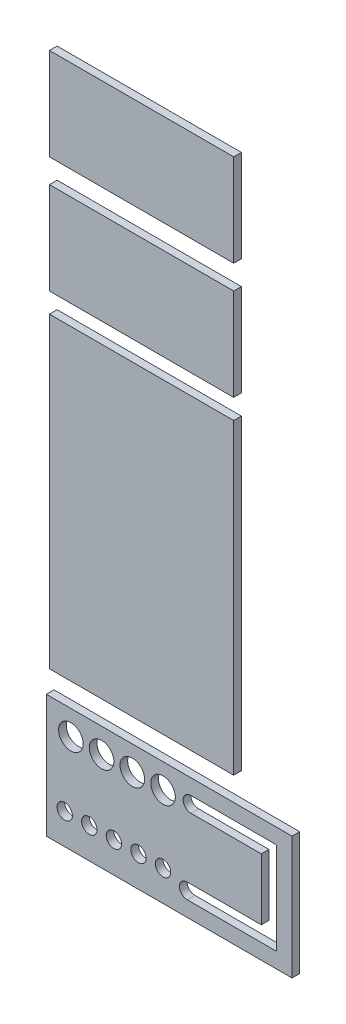
ISO-10303-21;
HEADER;
FILE_DESCRIPTION(('STEP AP214'),'2;1');
FILE_NAME('part.step','',(''),(''),'','','');
FILE_SCHEMA(('AUTOMOTIVE_DESIGN { 1 0 10303 214 1 1 1 1 }'));
ENDSEC;
DATA;
#1=APPLICATION_CONTEXT('core data for automotive mechanical design processes');
#2=APPLICATION_PROTOCOL_DEFINITION('international standard','automotive_design',2000,#1);
#3=PRODUCT_CONTEXT('',#1,'mechanical');
#4=PRODUCT('Part','Part','',(#3));
#5=PRODUCT_RELATED_PRODUCT_CATEGORY('part','',(#4));
#6=PRODUCT_DEFINITION_FORMATION('','',#4);
#7=PRODUCT_DEFINITION_CONTEXT('part definition',#1,'design');
#8=PRODUCT_DEFINITION('design','',#6,#7);
#9=PRODUCT_DEFINITION_SHAPE('','',#8);
#10=(LENGTH_UNIT() NAMED_UNIT(*) SI_UNIT(.MILLI.,.METRE.));
#11=(NAMED_UNIT(*) PLANE_ANGLE_UNIT() SI_UNIT($,.RADIAN.));
#12=(NAMED_UNIT(*) SI_UNIT($,.STERADIAN.) SOLID_ANGLE_UNIT());
#13=UNCERTAINTY_MEASURE_WITH_UNIT(LENGTH_MEASURE(1.E-05),#10,'distance_accuracy_value','');
#14=(GEOMETRIC_REPRESENTATION_CONTEXT(3) GLOBAL_UNCERTAINTY_ASSIGNED_CONTEXT((#13)) GLOBAL_UNIT_ASSIGNED_CONTEXT((#10,
#11,#12)) REPRESENTATION_CONTEXT('',''));
#15=CARTESIAN_POINT('',(0.,0.,0.));
#16=DIRECTION('',(0.,0.,1.));
#17=DIRECTION('',(1.,0.,0.));
#18=AXIS2_PLACEMENT_3D('',#15,#16,#17);
#19=CARTESIAN_POINT('',(7.52498324255558,237.752437589066,3.175));
#20=DIRECTION('',(1.,0.,0.));
#21=DIRECTION('',(0.,0.,-1.));
#22=AXIS2_PLACEMENT_3D('',#19,#20,#21);
#23=PLANE('',#22);
#24=DIRECTION('',(0.,-1.,0.));
#25=VECTOR('',#24,1.);
#26=CARTESIAN_POINT('',(7.52498324255558,237.752437589066,0.));
#27=LINE('',#26,#25);
#28=CARTESIAN_POINT('',(7.52498324255558,237.752437589066,0.));
#29=VERTEX_POINT('',#28);
#30=CARTESIAN_POINT('',(7.52498324255558,199.652437589066,0.));
#31=VERTEX_POINT('',#30);
#32=EDGE_CURVE('E107',#29,#31,#27,.T.);
#33=ORIENTED_EDGE('',*,*,#32,.T.);
#34=DIRECTION('',(0.,0.,-1.));
#35=VECTOR('',#34,1.);
#36=CARTESIAN_POINT('',(7.52498324255558,199.652437589066,3.175));
#37=LINE('',#36,#35);
#38=CARTESIAN_POINT('',(7.52498324255558,199.652437589066,3.175));
#39=VERTEX_POINT('',#38);
#40=EDGE_CURVE('E12',#39,#31,#37,.T.);
#41=ORIENTED_EDGE('',*,*,#40,.F.);
#42=DIRECTION('',(0.,-1.,0.));
#43=VECTOR('',#42,1.);
#44=CARTESIAN_POINT('',(7.52498324255558,237.752437589066,3.175));
#45=LINE('',#44,#43);
#46=CARTESIAN_POINT('',(7.52498324255558,237.752437589066,3.175));
#47=VERTEX_POINT('',#46);
#48=EDGE_CURVE('E95',#47,#39,#45,.T.);
#49=ORIENTED_EDGE('',*,*,#48,.F.);
#50=DIRECTION('',(0.,0.,-1.));
#51=VECTOR('',#50,1.);
#52=CARTESIAN_POINT('',(7.52498324255558,237.752437589066,3.175));
#53=LINE('',#52,#51);
#54=EDGE_CURVE('E103',#47,#29,#53,.T.);
#55=ORIENTED_EDGE('',*,*,#54,.T.);
#56=EDGE_LOOP('',(#33,#41,#49,#55));
#57=FACE_BOUND('',#56,.T.);
#58=ADVANCED_FACE('F44',(#57),#23,.F.);
#59=CARTESIAN_POINT('',(7.52498324255558,199.652437589066,3.175));
#60=DIRECTION('',(0.,1.,0.));
#61=DIRECTION('',(-1.,0.,0.));
#62=AXIS2_PLACEMENT_3D('',#59,#60,#61);
#63=PLANE('',#62);
#64=DIRECTION('',(1.,0.,0.));
#65=VECTOR('',#64,1.);
#66=CARTESIAN_POINT('',(7.52498324255558,199.652437589066,0.));
#67=LINE('',#66,#65);
#68=CARTESIAN_POINT('',(83.7249832425556,199.652437589066,0.));
#69=VERTEX_POINT('',#68);
#70=EDGE_CURVE('E99',#31,#69,#67,.T.);
#71=ORIENTED_EDGE('',*,*,#70,.T.);
#72=DIRECTION('',(0.,0.,-1.));
#73=VECTOR('',#72,1.);
#74=CARTESIAN_POINT('',(83.7249832425556,199.652437589066,3.175));
#75=LINE('',#74,#73);
#76=CARTESIAN_POINT('',(83.7249832425556,199.652437589066,3.175));
#77=VERTEX_POINT('',#76);
#78=EDGE_CURVE('E52',#77,#69,#75,.T.);
#79=ORIENTED_EDGE('',*,*,#78,.F.);
#80=DIRECTION('',(1.,0.,0.));
#81=VECTOR('',#80,1.);
#82=CARTESIAN_POINT('',(7.52498324255558,199.652437589066,3.175));
#83=LINE('',#82,#81);
#84=EDGE_CURVE('E90',#39,#77,#83,.T.);
#85=ORIENTED_EDGE('',*,*,#84,.F.);
#86=ORIENTED_EDGE('',*,*,#40,.T.);
#87=EDGE_LOOP('',(#71,#79,#85,#86));
#88=FACE_BOUND('',#87,.T.);
#89=ADVANCED_FACE('F98',(#88),#63,.F.);
#90=CARTESIAN_POINT('',(83.7249832425556,237.752437589066,3.175));
#91=DIRECTION('',(-1.,0.,0.));
#92=DIRECTION('',(0.,0.,1.));
#93=AXIS2_PLACEMENT_3D('',#90,#91,#92);
#94=PLANE('',#93);
#95=DIRECTION('',(0.,1.,0.));
#96=VECTOR('',#95,1.);
#97=CARTESIAN_POINT('',(83.7249832425556,237.752437589066,0.));
#98=LINE('',#97,#96);
#99=CARTESIAN_POINT('',(83.7249832425556,237.752437589066,0.));
#100=VERTEX_POINT('',#99);
#101=EDGE_CURVE('E77',#69,#100,#98,.T.);
#102=ORIENTED_EDGE('',*,*,#101,.T.);
#103=DIRECTION('',(0.,0.,-1.));
#104=VECTOR('',#103,1.);
#105=CARTESIAN_POINT('',(83.7249832425556,237.752437589066,3.175));
#106=LINE('',#105,#104);
#107=CARTESIAN_POINT('',(83.7249832425556,237.752437589066,3.175));
#108=VERTEX_POINT('',#107);
#109=EDGE_CURVE('E100',#108,#100,#106,.T.);
#110=ORIENTED_EDGE('',*,*,#109,.F.);
#111=DIRECTION('',(0.,1.,0.));
#112=VECTOR('',#111,1.);
#113=CARTESIAN_POINT('',(83.7249832425556,237.752437589066,3.175));
#114=LINE('',#113,#112);
#115=EDGE_CURVE('E93',#77,#108,#114,.T.);
#116=ORIENTED_EDGE('',*,*,#115,.F.);
#117=ORIENTED_EDGE('',*,*,#78,.T.);
#118=EDGE_LOOP('',(#102,#110,#116,#117));
#119=FACE_BOUND('',#118,.T.);
#120=ADVANCED_FACE('F101',(#119),#94,.F.);
#121=CARTESIAN_POINT('',(7.52498324255558,237.752437589066,3.175));
#122=DIRECTION('',(0.,-1.,0.));
#123=DIRECTION('',(0.,0.,-1.));
#124=AXIS2_PLACEMENT_3D('',#121,#122,#123);
#125=PLANE('',#124);
#126=DIRECTION('',(-1.,0.,0.));
#127=VECTOR('',#126,1.);
#128=CARTESIAN_POINT('',(7.52498324255558,237.752437589066,0.));
#129=LINE('',#128,#127);
#130=EDGE_CURVE('E83',#100,#29,#129,.T.);
#131=ORIENTED_EDGE('',*,*,#130,.T.);
#132=ORIENTED_EDGE('',*,*,#54,.F.);
#133=DIRECTION('',(-1.,0.,0.));
#134=VECTOR('',#133,1.);
#135=CARTESIAN_POINT('',(7.52498324255558,237.752437589066,3.175));
#136=LINE('',#135,#134);
#137=EDGE_CURVE('E60',#108,#47,#136,.T.);
#138=ORIENTED_EDGE('',*,*,#137,.F.);
#139=ORIENTED_EDGE('',*,*,#109,.T.);
#140=EDGE_LOOP('',(#131,#132,#138,#139));
#141=FACE_BOUND('',#140,.T.);
#142=ADVANCED_FACE('F114',(#141),#125,.F.);
#143=CARTESIAN_POINT('',(0.,0.,3.175));
#144=DIRECTION('',(0.,0.,1.));
#145=DIRECTION('',(1.,0.,0.));
#146=AXIS2_PLACEMENT_3D('',#143,#144,#145);
#147=PLANE('',#146);
#148=ORIENTED_EDGE('',*,*,#48,.T.);
#149=ORIENTED_EDGE('',*,*,#84,.T.);
#150=ORIENTED_EDGE('',*,*,#115,.T.);
#151=ORIENTED_EDGE('',*,*,#137,.T.);
#152=EDGE_LOOP('',(#148,#149,#150,#151));
#153=FACE_BOUND('',#152,.T.);
#154=ADVANCED_FACE('F91',(#153),#147,.T.);
#155=CARTESIAN_POINT('',(0.,0.,0.));
#156=DIRECTION('',(0.,0.,1.));
#157=DIRECTION('',(1.,0.,0.));
#158=AXIS2_PLACEMENT_3D('',#155,#156,#157);
#159=PLANE('',#158);
#160=ORIENTED_EDGE('',*,*,#32,.F.);
#161=ORIENTED_EDGE('',*,*,#130,.F.);
#162=ORIENTED_EDGE('',*,*,#101,.F.);
#163=ORIENTED_EDGE('',*,*,#70,.F.);
#164=EDGE_LOOP('',(#160,#161,#162,#163));
#165=FACE_BOUND('',#164,.T.);
#166=ADVANCED_FACE('F117',(#165),#159,.F.);
#167=CLOSED_SHELL('',(#58,#89,#120,#142,#154,#166));
#168=MANIFOLD_SOLID_BREP('B2',#167);
#169=CARTESIAN_POINT('',(7.52498324255558,285.797740762104,3.175));
#170=DIRECTION('',(1.,0.,0.));
#171=DIRECTION('',(0.,0.,-1.));
#172=AXIS2_PLACEMENT_3D('',#169,#170,#171);
#173=PLANE('',#172);
#174=DIRECTION('',(0.,-1.,0.));
#175=VECTOR('',#174,1.);
#176=CARTESIAN_POINT('',(7.52498324255558,285.797740762104,0.));
#177=LINE('',#176,#175);
#178=CARTESIAN_POINT('',(7.52498324255558,285.797740762104,0.));
#179=VERTEX_POINT('',#178);
#180=CARTESIAN_POINT('',(7.52498324255558,247.697740762104,0.));
#181=VERTEX_POINT('',#180);
#182=EDGE_CURVE('E241',#179,#181,#177,.T.);
#183=ORIENTED_EDGE('',*,*,#182,.T.);
#184=DIRECTION('',(0.,0.,-1.));
#185=VECTOR('',#184,1.);
#186=CARTESIAN_POINT('',(7.52498324255558,247.697740762104,3.175));
#187=LINE('',#186,#185);
#188=CARTESIAN_POINT('',(7.52498324255558,247.697740762104,3.175));
#189=VERTEX_POINT('',#188);
#190=EDGE_CURVE('E42',#189,#181,#187,.T.);
#191=ORIENTED_EDGE('',*,*,#190,.F.);
#192=DIRECTION('',(0.,-1.,0.));
#193=VECTOR('',#192,1.);
#194=CARTESIAN_POINT('',(7.52498324255558,285.797740762104,3.175));
#195=LINE('',#194,#193);
#196=CARTESIAN_POINT('',(7.52498324255558,285.797740762104,3.175));
#197=VERTEX_POINT('',#196);
#198=EDGE_CURVE('E229',#197,#189,#195,.T.);
#199=ORIENTED_EDGE('',*,*,#198,.F.);
#200=DIRECTION('',(0.,0.,-1.));
#201=VECTOR('',#200,1.);
#202=CARTESIAN_POINT('',(7.52498324255558,285.797740762104,3.175));
#203=LINE('',#202,#201);
#204=EDGE_CURVE('E237',#197,#179,#203,.T.);
#205=ORIENTED_EDGE('',*,*,#204,.T.);
#206=EDGE_LOOP('',(#183,#191,#199,#205));
#207=FACE_BOUND('',#206,.T.);
#208=ADVANCED_FACE('F178',(#207),#173,.F.);
#209=CARTESIAN_POINT('',(7.52498324255558,247.697740762104,3.175));
#210=DIRECTION('',(0.,1.,0.));
#211=DIRECTION('',(-1.,0.,0.));
#212=AXIS2_PLACEMENT_3D('',#209,#210,#211);
#213=PLANE('',#212);
#214=DIRECTION('',(1.,0.,0.));
#215=VECTOR('',#214,1.);
#216=CARTESIAN_POINT('',(7.52498324255558,247.697740762104,0.));
#217=LINE('',#216,#215);
#218=CARTESIAN_POINT('',(83.7249832425556,247.697740762104,0.));
#219=VERTEX_POINT('',#218);
#220=EDGE_CURVE('E233',#181,#219,#217,.T.);
#221=ORIENTED_EDGE('',*,*,#220,.T.);
#222=DIRECTION('',(0.,0.,-1.));
#223=VECTOR('',#222,1.);
#224=CARTESIAN_POINT('',(83.7249832425556,247.697740762104,3.175));
#225=LINE('',#224,#223);
#226=CARTESIAN_POINT('',(83.7249832425556,247.697740762104,3.175));
#227=VERTEX_POINT('',#226);
#228=EDGE_CURVE('E186',#227,#219,#225,.T.);
#229=ORIENTED_EDGE('',*,*,#228,.F.);
#230=DIRECTION('',(1.,0.,0.));
#231=VECTOR('',#230,1.);
#232=CARTESIAN_POINT('',(7.52498324255558,247.697740762104,3.175));
#233=LINE('',#232,#231);
#234=EDGE_CURVE('E224',#189,#227,#233,.T.);
#235=ORIENTED_EDGE('',*,*,#234,.F.);
#236=ORIENTED_EDGE('',*,*,#190,.T.);
#237=EDGE_LOOP('',(#221,#229,#235,#236));
#238=FACE_BOUND('',#237,.T.);
#239=ADVANCED_FACE('F232',(#238),#213,.F.);
#240=CARTESIAN_POINT('',(83.7249832425556,285.797740762104,3.175));
#241=DIRECTION('',(-1.,0.,0.));
#242=DIRECTION('',(0.,-1.,0.));
#243=AXIS2_PLACEMENT_3D('',#240,#241,#242);
#244=PLANE('',#243);
#245=DIRECTION('',(0.,1.,0.));
#246=VECTOR('',#245,1.);
#247=CARTESIAN_POINT('',(83.7249832425556,285.797740762104,0.));
#248=LINE('',#247,#246);
#249=CARTESIAN_POINT('',(83.7249832425556,285.797740762104,0.));
#250=VERTEX_POINT('',#249);
#251=EDGE_CURVE('E211',#219,#250,#248,.T.);
#252=ORIENTED_EDGE('',*,*,#251,.T.);
#253=DIRECTION('',(0.,0.,-1.));
#254=VECTOR('',#253,1.);
#255=CARTESIAN_POINT('',(83.7249832425556,285.797740762104,3.175));
#256=LINE('',#255,#254);
#257=CARTESIAN_POINT('',(83.7249832425556,285.797740762104,3.175));
#258=VERTEX_POINT('',#257);
#259=EDGE_CURVE('E234',#258,#250,#256,.T.);
#260=ORIENTED_EDGE('',*,*,#259,.F.);
#261=DIRECTION('',(0.,1.,0.));
#262=VECTOR('',#261,1.);
#263=CARTESIAN_POINT('',(83.7249832425556,285.797740762104,3.175));
#264=LINE('',#263,#262);
#265=EDGE_CURVE('E227',#227,#258,#264,.T.);
#266=ORIENTED_EDGE('',*,*,#265,.F.);
#267=ORIENTED_EDGE('',*,*,#228,.T.);
#268=EDGE_LOOP('',(#252,#260,#266,#267));
#269=FACE_BOUND('',#268,.T.);
#270=ADVANCED_FACE('F235',(#269),#244,.F.);
#271=CARTESIAN_POINT('',(7.52498324255558,285.797740762104,3.175));
#272=DIRECTION('',(0.,-1.,0.));
#273=DIRECTION('',(0.,0.,-1.));
#274=AXIS2_PLACEMENT_3D('',#271,#272,#273);
#275=PLANE('',#274);
#276=DIRECTION('',(-1.,0.,0.));
#277=VECTOR('',#276,1.);
#278=CARTESIAN_POINT('',(7.52498324255558,285.797740762104,0.));
#279=LINE('',#278,#277);
#280=EDGE_CURVE('E217',#250,#179,#279,.T.);
#281=ORIENTED_EDGE('',*,*,#280,.T.);
#282=ORIENTED_EDGE('',*,*,#204,.F.);
#283=DIRECTION('',(-1.,0.,0.));
#284=VECTOR('',#283,1.);
#285=CARTESIAN_POINT('',(7.52498324255558,285.797740762104,3.175));
#286=LINE('',#285,#284);
#287=EDGE_CURVE('E194',#258,#197,#286,.T.);
#288=ORIENTED_EDGE('',*,*,#287,.F.);
#289=ORIENTED_EDGE('',*,*,#259,.T.);
#290=EDGE_LOOP('',(#281,#282,#288,#289));
#291=FACE_BOUND('',#290,.T.);
#292=ADVANCED_FACE('F248',(#291),#275,.F.);
#293=CARTESIAN_POINT('',(0.,0.,3.175));
#294=DIRECTION('',(0.,0.,1.));
#295=DIRECTION('',(1.,0.,0.));
#296=AXIS2_PLACEMENT_3D('',#293,#294,#295);
#297=PLANE('',#296);
#298=ORIENTED_EDGE('',*,*,#198,.T.);
#299=ORIENTED_EDGE('',*,*,#234,.T.);
#300=ORIENTED_EDGE('',*,*,#265,.T.);
#301=ORIENTED_EDGE('',*,*,#287,.T.);
#302=EDGE_LOOP('',(#298,#299,#300,#301));
#303=FACE_BOUND('',#302,.T.);
#304=ADVANCED_FACE('F225',(#303),#297,.T.);
#305=CARTESIAN_POINT('',(0.,0.,0.));
#306=DIRECTION('',(0.,0.,1.));
#307=DIRECTION('',(1.,0.,0.));
#308=AXIS2_PLACEMENT_3D('',#305,#306,#307);
#309=PLANE('',#308);
#310=ORIENTED_EDGE('',*,*,#182,.F.);
#311=ORIENTED_EDGE('',*,*,#280,.F.);
#312=ORIENTED_EDGE('',*,*,#251,.F.);
#313=ORIENTED_EDGE('',*,*,#220,.F.);
#314=EDGE_LOOP('',(#310,#311,#312,#313));
#315=FACE_BOUND('',#314,.T.);
#316=ADVANCED_FACE('F251',(#315),#309,.F.);
#317=CLOSED_SHELL('',(#208,#239,#270,#292,#304,#316));
#318=MANIFOLD_SOLID_BREP('B6',#317);
#319=CARTESIAN_POINT('',(7.52498324255558,191.387090926258,3.175));
#320=DIRECTION('',(1.,0.,0.));
#321=DIRECTION('',(0.,0.,-1.));
#322=AXIS2_PLACEMENT_3D('',#319,#320,#321);
#323=PLANE('',#322);
#324=DIRECTION('',(0.,-1.,0.));
#325=VECTOR('',#324,1.);
#326=CARTESIAN_POINT('',(7.52498324255558,191.387090926258,0.));
#327=LINE('',#326,#325);
#328=CARTESIAN_POINT('',(7.52498324255558,191.387090926258,0.));
#329=VERTEX_POINT('',#328);
#330=CARTESIAN_POINT('',(7.52498324255558,64.3870909262584,0.));
#331=VERTEX_POINT('',#330);
#332=EDGE_CURVE('E374',#329,#331,#327,.T.);
#333=ORIENTED_EDGE('',*,*,#332,.T.);
#334=DIRECTION('',(0.,0.,-1.));
#335=VECTOR('',#334,1.);
#336=CARTESIAN_POINT('',(7.52498324255558,64.3870909262584,3.175));
#337=LINE('',#336,#335);
#338=CARTESIAN_POINT('',(7.52498324255558,64.3870909262584,3.175));
#339=VERTEX_POINT('',#338);
#340=EDGE_CURVE('E176',#339,#331,#337,.T.);
#341=ORIENTED_EDGE('',*,*,#340,.F.);
#342=DIRECTION('',(0.,-1.,0.));
#343=VECTOR('',#342,1.);
#344=CARTESIAN_POINT('',(7.52498324255558,191.387090926258,3.175));
#345=LINE('',#344,#343);
#346=CARTESIAN_POINT('',(7.52498324255558,191.387090926258,3.175));
#347=VERTEX_POINT('',#346);
#348=EDGE_CURVE('E362',#347,#339,#345,.T.);
#349=ORIENTED_EDGE('',*,*,#348,.F.);
#350=DIRECTION('',(0.,0.,-1.));
#351=VECTOR('',#350,1.);
#352=CARTESIAN_POINT('',(7.52498324255558,191.387090926258,3.175));
#353=LINE('',#352,#351);
#354=EDGE_CURVE('E370',#347,#329,#353,.T.);
#355=ORIENTED_EDGE('',*,*,#354,.T.);
#356=EDGE_LOOP('',(#333,#341,#349,#355));
#357=FACE_BOUND('',#356,.T.);
#358=ADVANCED_FACE('F311',(#357),#323,.F.);
#359=CARTESIAN_POINT('',(7.52498324255558,64.3870909262584,3.175));
#360=DIRECTION('',(0.,1.,0.));
#361=DIRECTION('',(-1.,0.,0.));
#362=AXIS2_PLACEMENT_3D('',#359,#360,#361);
#363=PLANE('',#362);
#364=DIRECTION('',(1.,0.,0.));
#365=VECTOR('',#364,1.);
#366=CARTESIAN_POINT('',(7.52498324255558,64.3870909262584,0.));
#367=LINE('',#366,#365);
#368=CARTESIAN_POINT('',(83.7249832425556,64.3870909262584,0.));
#369=VERTEX_POINT('',#368);
#370=EDGE_CURVE('E366',#331,#369,#367,.T.);
#371=ORIENTED_EDGE('',*,*,#370,.T.);
#372=DIRECTION('',(0.,0.,-1.));
#373=VECTOR('',#372,1.);
#374=CARTESIAN_POINT('',(83.7249832425556,64.3870909262584,3.175));
#375=LINE('',#374,#373);
#376=CARTESIAN_POINT('',(83.7249832425556,64.3870909262584,3.175));
#377=VERTEX_POINT('',#376);
#378=EDGE_CURVE('E319',#377,#369,#375,.T.);
#379=ORIENTED_EDGE('',*,*,#378,.F.);
#380=DIRECTION('',(1.,0.,0.));
#381=VECTOR('',#380,1.);
#382=CARTESIAN_POINT('',(7.52498324255558,64.3870909262584,3.175));
#383=LINE('',#382,#381);
#384=EDGE_CURVE('E357',#339,#377,#383,.T.);
#385=ORIENTED_EDGE('',*,*,#384,.F.);
#386=ORIENTED_EDGE('',*,*,#340,.T.);
#387=EDGE_LOOP('',(#371,#379,#385,#386));
#388=FACE_BOUND('',#387,.T.);
#389=ADVANCED_FACE('F365',(#388),#363,.F.);
#390=CARTESIAN_POINT('',(83.7249832425556,191.387090926258,3.175));
#391=DIRECTION('',(-1.,0.,0.));
#392=DIRECTION('',(0.,0.,1.));
#393=AXIS2_PLACEMENT_3D('',#390,#391,#392);
#394=PLANE('',#393);
#395=DIRECTION('',(0.,1.,0.));
#396=VECTOR('',#395,1.);
#397=CARTESIAN_POINT('',(83.7249832425556,191.387090926258,0.));
#398=LINE('',#397,#396);
#399=CARTESIAN_POINT('',(83.7249832425556,191.387090926258,0.));
#400=VERTEX_POINT('',#399);
#401=EDGE_CURVE('E344',#369,#400,#398,.T.);
#402=ORIENTED_EDGE('',*,*,#401,.T.);
#403=DIRECTION('',(0.,0.,-1.));
#404=VECTOR('',#403,1.);
#405=CARTESIAN_POINT('',(83.7249832425556,191.387090926258,3.175));
#406=LINE('',#405,#404);
#407=CARTESIAN_POINT('',(83.7249832425556,191.387090926258,3.175));
#408=VERTEX_POINT('',#407);
#409=EDGE_CURVE('E367',#408,#400,#406,.T.);
#410=ORIENTED_EDGE('',*,*,#409,.F.);
#411=DIRECTION('',(0.,1.,0.));
#412=VECTOR('',#411,1.);
#413=CARTESIAN_POINT('',(83.7249832425556,191.387090926258,3.175));
#414=LINE('',#413,#412);
#415=EDGE_CURVE('E360',#377,#408,#414,.T.);
#416=ORIENTED_EDGE('',*,*,#415,.F.);
#417=ORIENTED_EDGE('',*,*,#378,.T.);
#418=EDGE_LOOP('',(#402,#410,#416,#417));
#419=FACE_BOUND('',#418,.T.);
#420=ADVANCED_FACE('F368',(#419),#394,.F.);
#421=CARTESIAN_POINT('',(7.52498324255558,191.387090926258,3.175));
#422=DIRECTION('',(0.,-1.,0.));
#423=DIRECTION('',(0.,0.,-1.));
#424=AXIS2_PLACEMENT_3D('',#421,#422,#423);
#425=PLANE('',#424);
#426=DIRECTION('',(-1.,0.,0.));
#427=VECTOR('',#426,1.);
#428=CARTESIAN_POINT('',(7.52498324255558,191.387090926258,0.));
#429=LINE('',#428,#427);
#430=EDGE_CURVE('E350',#400,#329,#429,.T.);
#431=ORIENTED_EDGE('',*,*,#430,.T.);
#432=ORIENTED_EDGE('',*,*,#354,.F.);
#433=DIRECTION('',(-1.,0.,0.));
#434=VECTOR('',#433,1.);
#435=CARTESIAN_POINT('',(7.52498324255558,191.387090926258,3.175));
#436=LINE('',#435,#434);
#437=EDGE_CURVE('E327',#408,#347,#436,.T.);
#438=ORIENTED_EDGE('',*,*,#437,.F.);
#439=ORIENTED_EDGE('',*,*,#409,.T.);
#440=EDGE_LOOP('',(#431,#432,#438,#439));
#441=FACE_BOUND('',#440,.T.);
#442=ADVANCED_FACE('F381',(#441),#425,.F.);
#443=CARTESIAN_POINT('',(0.,0.,3.175));
#444=DIRECTION('',(0.,0.,1.));
#445=DIRECTION('',(1.,0.,0.));
#446=AXIS2_PLACEMENT_3D('',#443,#444,#445);
#447=PLANE('',#446);
#448=ORIENTED_EDGE('',*,*,#348,.T.);
#449=ORIENTED_EDGE('',*,*,#384,.T.);
#450=ORIENTED_EDGE('',*,*,#415,.T.);
#451=ORIENTED_EDGE('',*,*,#437,.T.);
#452=EDGE_LOOP('',(#448,#449,#450,#451));
#453=FACE_BOUND('',#452,.T.);
#454=ADVANCED_FACE('F358',(#453),#447,.T.);
#455=CARTESIAN_POINT('',(0.,0.,0.));
#456=DIRECTION('',(0.,0.,1.));
#457=DIRECTION('',(1.,0.,0.));
#458=AXIS2_PLACEMENT_3D('',#455,#456,#457);
#459=PLANE('',#458);
#460=ORIENTED_EDGE('',*,*,#332,.F.);
#461=ORIENTED_EDGE('',*,*,#430,.F.);
#462=ORIENTED_EDGE('',*,*,#401,.F.);
#463=ORIENTED_EDGE('',*,*,#370,.F.);
#464=EDGE_LOOP('',(#460,#461,#462,#463));
#465=FACE_BOUND('',#464,.T.);
#466=ADVANCED_FACE('F384',(#465),#459,.F.);
#467=CLOSED_SHELL('',(#358,#389,#420,#442,#454,#466));
#468=MANIFOLD_SOLID_BREP('B36',#467);
#469=CARTESIAN_POINT('',(0.,0.,3.175));
#470=DIRECTION('',(0.,0.,-1.));
#471=DIRECTION('',(-1.,0.,0.));
#472=AXIS2_PLACEMENT_3D('',#469,#470,#471);
#473=PLANE('',#472);
#474=CARTESIAN_POINT('',(16.3958461785447,44.4654872741233,3.175));
#475=DIRECTION('',(0.,0.,1.));
#476=DIRECTION('',(1.,0.,0.));
#477=AXIS2_PLACEMENT_3D('',#474,#475,#476);
#478=CIRCLE('',#477,5.08);
#479=CARTESIAN_POINT('',(21.4758461785447,44.4654872741233,3.175));
#480=VERTEX_POINT('',#479);
#481=EDGE_CURVE('E592',#480,#480,#478,.T.);
#482=ORIENTED_EDGE('',*,*,#481,.F.);
#483=EDGE_LOOP('',(#482));
#484=FACE_BOUND('',#483,.T.);
#485=CARTESIAN_POINT('',(54.4958461785447,16.5254872741233,3.175));
#486=DIRECTION('',(0.,0.,1.));
#487=DIRECTION('',(1.,0.,0.));
#488=AXIS2_PLACEMENT_3D('',#485,#486,#487);
#489=CIRCLE('',#488,3.175);
#490=CARTESIAN_POINT('',(57.6708461785447,16.5254872741233,3.175));
#491=VERTEX_POINT('',#490);
#492=EDGE_CURVE('E598',#491,#491,#489,.T.);
#493=ORIENTED_EDGE('',*,*,#492,.F.);
#494=EDGE_LOOP('',(#493));
#495=FACE_BOUND('',#494,.T.);
#496=CARTESIAN_POINT('',(44.3358461785447,16.5254872741233,3.175));
#497=DIRECTION('',(0.,0.,1.));
#498=DIRECTION('',(1.,0.,0.));
#499=AXIS2_PLACEMENT_3D('',#496,#497,#498);
#500=CIRCLE('',#499,3.175);
#501=CARTESIAN_POINT('',(47.5108461785447,16.5254872741233,3.175));
#502=VERTEX_POINT('',#501);
#503=EDGE_CURVE('E604',#502,#502,#500,.T.);
#504=ORIENTED_EDGE('',*,*,#503,.F.);
#505=EDGE_LOOP('',(#504));
#506=FACE_BOUND('',#505,.T.);
#507=CARTESIAN_POINT('',(34.1758461785447,16.5254872741233,3.175));
#508=DIRECTION('',(0.,0.,1.));
#509=DIRECTION('',(1.,0.,0.));
#510=AXIS2_PLACEMENT_3D('',#507,#508,#509);
#511=CIRCLE('',#510,3.175);
#512=CARTESIAN_POINT('',(37.3508461785447,16.5254872741233,3.175));
#513=VERTEX_POINT('',#512);
#514=EDGE_CURVE('E610',#513,#513,#511,.T.);
#515=ORIENTED_EDGE('',*,*,#514,.F.);
#516=EDGE_LOOP('',(#515));
#517=FACE_BOUND('',#516,.T.);
#518=CARTESIAN_POINT('',(24.0158461785447,16.5254872741233,3.175));
#519=DIRECTION('',(0.,0.,1.));
#520=DIRECTION('',(1.,0.,0.));
#521=AXIS2_PLACEMENT_3D('',#518,#519,#520);
#522=CIRCLE('',#521,3.175);
#523=CARTESIAN_POINT('',(27.1908461785447,16.5254872741233,3.175));
#524=VERTEX_POINT('',#523);
#525=EDGE_CURVE('E616',#524,#524,#522,.T.);
#526=ORIENTED_EDGE('',*,*,#525,.F.);
#527=EDGE_LOOP('',(#526));
#528=FACE_BOUND('',#527,.T.);
#529=CARTESIAN_POINT('',(13.8558461785447,16.5254872741233,3.175));
#530=DIRECTION('',(0.,0.,1.));
#531=DIRECTION('',(1.,0.,0.));
#532=AXIS2_PLACEMENT_3D('',#529,#530,#531);
#533=CIRCLE('',#532,3.175);
#534=CARTESIAN_POINT('',(17.0308461785447,16.5254872741233,3.175));
#535=VERTEX_POINT('',#534);
#536=EDGE_CURVE('E622',#535,#535,#533,.T.);
#537=ORIENTED_EDGE('',*,*,#536,.F.);
#538=EDGE_LOOP('',(#537));
#539=FACE_BOUND('',#538,.T.);
#540=DIRECTION('',(0.,-1.,0.));
#541=VECTOR('',#540,1.);
#542=CARTESIAN_POINT('',(6.23584617854467,3.82548727412332,3.175));
#543=LINE('',#542,#541);
#544=CARTESIAN_POINT('',(6.23584617854467,54.6254872741233,3.175));
#545=VERTEX_POINT('',#544);
#546=CARTESIAN_POINT('',(6.23584617854467,3.82548727412332,3.175));
#547=VERTEX_POINT('',#546);
#548=EDGE_CURVE('E628',#545,#547,#543,.T.);
#549=ORIENTED_EDGE('',*,*,#548,.T.);
#550=DIRECTION('',(1.,0.,0.));
#551=VECTOR('',#550,1.);
#552=CARTESIAN_POINT('',(6.23584617854467,3.82548727412332,3.175));
#553=LINE('',#552,#551);
#554=CARTESIAN_POINT('',(107.835846178545,3.82548727412332,3.175));
#555=VERTEX_POINT('',#554);
#556=EDGE_CURVE('E631',#547,#555,#553,.T.);
#557=ORIENTED_EDGE('',*,*,#556,.T.);
#558=DIRECTION('',(0.,1.,0.));
#559=VECTOR('',#558,1.);
#560=CARTESIAN_POINT('',(107.835846178545,3.82548727412332,3.175));
#561=LINE('',#560,#559);
#562=CARTESIAN_POINT('',(107.835846178545,54.6254872741233,3.175));
#563=VERTEX_POINT('',#562);
#564=EDGE_CURVE('E634',#555,#563,#561,.T.);
#565=ORIENTED_EDGE('',*,*,#564,.T.);
#566=DIRECTION('',(-1.,0.,0.));
#567=VECTOR('',#566,1.);
#568=CARTESIAN_POINT('',(6.23584617854467,54.6254872741233,3.175));
#569=LINE('',#568,#567);
#570=EDGE_CURVE('E636',#563,#545,#569,.T.);
#571=ORIENTED_EDGE('',*,*,#570,.T.);
#572=EDGE_LOOP('',(#549,#557,#565,#571));
#573=FACE_BOUND('',#572,.T.);
#574=CARTESIAN_POINT('',(64.4665537697794,13.3504872741233,3.175));
#575=DIRECTION('',(0.,0.,1.));
#576=DIRECTION('',(1.,0.,0.));
#577=AXIS2_PLACEMENT_3D('',#574,#575,#576);
#578=CIRCLE('',#577,3.175);
#579=CARTESIAN_POINT('',(64.4665537697794,16.5254872741233,3.175));
#580=VERTEX_POINT('',#579);
#581=CARTESIAN_POINT('',(64.4665537697794,10.1754872741233,3.175));
#582=VERTEX_POINT('',#581);
#583=EDGE_CURVE('E524',#580,#582,#578,.T.);
#584=ORIENTED_EDGE('',*,*,#583,.F.);
#585=DIRECTION('',(-1.,0.,0.));
#586=VECTOR('',#585,1.);
#587=CARTESIAN_POINT('',(64.4665537697794,16.5254872741233,3.175));
#588=LINE('',#587,#586);
#589=CARTESIAN_POINT('',(95.1358461785447,16.5254872741233,3.175));
#590=VERTEX_POINT('',#589);
#591=EDGE_CURVE('E559',#590,#580,#588,.T.);
#592=ORIENTED_EDGE('',*,*,#591,.F.);
#593=DIRECTION('',(0.,-1.,0.));
#594=VECTOR('',#593,1.);
#595=CARTESIAN_POINT('',(95.1358461785447,16.5254872741233,3.175));
#596=LINE('',#595,#594);
#597=CARTESIAN_POINT('',(95.1358461785447,41.9254872741233,3.175));
#598=VERTEX_POINT('',#597);
#599=EDGE_CURVE('E557',#598,#590,#596,.T.);
#600=ORIENTED_EDGE('',*,*,#599,.F.);
#601=DIRECTION('',(1.,0.,0.));
#602=VECTOR('',#601,1.);
#603=CARTESIAN_POINT('',(95.1358461785447,41.9254872741233,3.175));
#604=LINE('',#603,#602);
#605=CARTESIAN_POINT('',(66.0048144654456,41.9254872741233,3.175));
#606=VERTEX_POINT('',#605);
#607=EDGE_CURVE('E555',#606,#598,#604,.T.);
#608=ORIENTED_EDGE('',*,*,#607,.F.);
#609=CARTESIAN_POINT('',(66.0048144654456,45.1004872741233,3.175));
#610=DIRECTION('',(0.,0.,1.));
#611=DIRECTION('',(-1.,0.,0.));
#612=AXIS2_PLACEMENT_3D('',#609,#610,#611);
#613=CIRCLE('',#612,3.175);
#614=CARTESIAN_POINT('',(66.0048144654456,48.2754872741233,3.175));
#615=VERTEX_POINT('',#614);
#616=EDGE_CURVE('E553',#615,#606,#613,.T.);
#617=ORIENTED_EDGE('',*,*,#616,.F.);
#618=DIRECTION('',(-1.,0.,0.));
#619=VECTOR('',#618,1.);
#620=CARTESIAN_POINT('',(66.0048144654456,48.2754872741233,3.175));
#621=LINE('',#620,#619);
#622=CARTESIAN_POINT('',(101.485846178545,48.2754872741233,3.175));
#623=VERTEX_POINT('',#622);
#624=EDGE_CURVE('E548',#623,#615,#621,.T.);
#625=ORIENTED_EDGE('',*,*,#624,.F.);
#626=DIRECTION('',(0.,1.,0.));
#627=VECTOR('',#626,1.);
#628=CARTESIAN_POINT('',(101.485846178545,48.2754872741233,3.175));
#629=LINE('',#628,#627);
#630=CARTESIAN_POINT('',(101.485846178545,10.1754872741233,3.175));
#631=VERTEX_POINT('',#630);
#632=EDGE_CURVE('E546',#631,#623,#629,.T.);
#633=ORIENTED_EDGE('',*,*,#632,.F.);
#634=DIRECTION('',(1.,0.,0.));
#635=VECTOR('',#634,1.);
#636=CARTESIAN_POINT('',(101.485846178545,10.1754872741233,3.175));
#637=LINE('',#636,#635);
#638=EDGE_CURVE('E532',#582,#631,#637,.T.);
#639=ORIENTED_EDGE('',*,*,#638,.F.);
#640=EDGE_LOOP('',(#584,#592,#600,#608,#617,#625,#633,#639));
#641=FACE_BOUND('',#640,.T.);
#642=CARTESIAN_POINT('',(29.0958461785447,44.4654872741233,3.175));
#643=DIRECTION('',(0.,0.,1.));
#644=DIRECTION('',(1.,0.,0.));
#645=AXIS2_PLACEMENT_3D('',#642,#643,#644);
#646=CIRCLE('',#645,5.08000000000001);
#647=CARTESIAN_POINT('',(34.1758461785447,44.4654872741233,3.175));
#648=VERTEX_POINT('',#647);
#649=EDGE_CURVE('E562',#648,#648,#646,.T.);
#650=ORIENTED_EDGE('',*,*,#649,.F.);
#651=EDGE_LOOP('',(#650));
#652=FACE_BOUND('',#651,.T.);
#653=CARTESIAN_POINT('',(41.7958461785447,44.4654872741233,3.175));
#654=DIRECTION('',(0.,0.,1.));
#655=DIRECTION('',(1.,0.,0.));
#656=AXIS2_PLACEMENT_3D('',#653,#654,#655);
#657=CIRCLE('',#656,5.08);
#658=CARTESIAN_POINT('',(46.8758461785447,44.4654872741233,3.175));
#659=VERTEX_POINT('',#658);
#660=EDGE_CURVE('E725',#659,#659,#657,.T.);
#661=ORIENTED_EDGE('',*,*,#660,.F.);
#662=EDGE_LOOP('',(#661));
#663=FACE_BOUND('',#662,.T.);
#664=CARTESIAN_POINT('',(54.4958461785447,44.4654872741233,3.175));
#665=DIRECTION('',(0.,0.,1.));
#666=DIRECTION('',(1.,0.,0.));
#667=AXIS2_PLACEMENT_3D('',#664,#665,#666);
#668=CIRCLE('',#667,5.08000000000001);
#669=CARTESIAN_POINT('',(59.5758461785447,44.4654872741233,3.175));
#670=VERTEX_POINT('',#669);
#671=EDGE_CURVE('E719',#670,#670,#668,.T.);
#672=ORIENTED_EDGE('',*,*,#671,.F.);
#673=EDGE_LOOP('',(#672));
#674=FACE_BOUND('',#673,.T.);
#675=ADVANCED_FACE('F435',(#484,#495,#506,#517,#528,#539,#573,#641,#652,#663,#674),#473,.F.);
#676=CARTESIAN_POINT('',(0.,0.,0.));
#677=DIRECTION('',(0.,0.,-1.));
#678=DIRECTION('',(-1.,0.,0.));
#679=AXIS2_PLACEMENT_3D('',#676,#677,#678);
#680=PLANE('',#679);
#681=CARTESIAN_POINT('',(41.7958461785447,44.4654872741233,0.));
#682=DIRECTION('',(0.,0.,1.));
#683=DIRECTION('',(1.,0.,0.));
#684=AXIS2_PLACEMENT_3D('',#681,#682,#683);
#685=CIRCLE('',#684,5.08);
#686=CARTESIAN_POINT('',(46.8758461785447,44.4654872741233,0.));
#687=VERTEX_POINT('',#686);
#688=EDGE_CURVE('E722',#687,#687,#685,.T.);
#689=ORIENTED_EDGE('',*,*,#688,.T.);
#690=EDGE_LOOP('',(#689));
#691=FACE_BOUND('',#690,.T.);
#692=DIRECTION('',(-1.,0.,0.));
#693=VECTOR('',#692,1.);
#694=CARTESIAN_POINT('',(64.4665537697794,16.5254872741233,0.));
#695=LINE('',#694,#693);
#696=CARTESIAN_POINT('',(95.1358461785447,16.5254872741233,0.));
#697=VERTEX_POINT('',#696);
#698=CARTESIAN_POINT('',(64.4665537697794,16.5254872741233,0.));
#699=VERTEX_POINT('',#698);
#700=EDGE_CURVE('E533',#697,#699,#695,.T.);
#701=ORIENTED_EDGE('',*,*,#700,.T.);
#702=CARTESIAN_POINT('',(64.4665537697794,13.3504872741233,0.));
#703=DIRECTION('',(0.,0.,1.));
#704=DIRECTION('',(1.,0.,0.));
#705=AXIS2_PLACEMENT_3D('',#702,#703,#704);
#706=CIRCLE('',#705,3.175);
#707=CARTESIAN_POINT('',(64.4665537697794,10.1754872741233,0.));
#708=VERTEX_POINT('',#707);
#709=EDGE_CURVE('E458',#699,#708,#706,.T.);
#710=ORIENTED_EDGE('',*,*,#709,.T.);
#711=DIRECTION('',(1.,0.,0.));
#712=VECTOR('',#711,1.);
#713=CARTESIAN_POINT('',(101.485846178545,10.1754872741233,0.));
#714=LINE('',#713,#712);
#715=CARTESIAN_POINT('',(101.485846178545,10.1754872741233,0.));
#716=VERTEX_POINT('',#715);
#717=EDGE_CURVE('E539',#708,#716,#714,.T.);
#718=ORIENTED_EDGE('',*,*,#717,.T.);
#719=DIRECTION('',(0.,1.,0.));
#720=VECTOR('',#719,1.);
#721=CARTESIAN_POINT('',(101.485846178545,48.2754872741233,0.));
#722=LINE('',#721,#720);
#723=CARTESIAN_POINT('',(101.485846178545,48.2754872741233,0.));
#724=VERTEX_POINT('',#723);
#725=EDGE_CURVE('E564',#716,#724,#722,.T.);
#726=ORIENTED_EDGE('',*,*,#725,.T.);
#727=DIRECTION('',(-1.,0.,0.));
#728=VECTOR('',#727,1.);
#729=CARTESIAN_POINT('',(66.0048144654456,48.2754872741233,0.));
#730=LINE('',#729,#728);
#731=CARTESIAN_POINT('',(66.0048144654456,48.2754872741233,0.));
#732=VERTEX_POINT('',#731);
#733=EDGE_CURVE('E567',#724,#732,#730,.T.);
#734=ORIENTED_EDGE('',*,*,#733,.T.);
#735=CARTESIAN_POINT('',(66.0048144654456,45.1004872741233,0.));
#736=DIRECTION('',(0.,0.,1.));
#737=DIRECTION('',(-1.,0.,0.));
#738=AXIS2_PLACEMENT_3D('',#735,#736,#737);
#739=CIRCLE('',#738,3.175);
#740=CARTESIAN_POINT('',(66.0048144654456,41.9254872741233,0.));
#741=VERTEX_POINT('',#740);
#742=EDGE_CURVE('E570',#732,#741,#739,.T.);
#743=ORIENTED_EDGE('',*,*,#742,.T.);
#744=DIRECTION('',(1.,0.,0.));
#745=VECTOR('',#744,1.);
#746=CARTESIAN_POINT('',(95.1358461785447,41.9254872741233,0.));
#747=LINE('',#746,#745);
#748=CARTESIAN_POINT('',(95.1358461785447,41.9254872741233,0.));
#749=VERTEX_POINT('',#748);
#750=EDGE_CURVE('E573',#741,#749,#747,.T.);
#751=ORIENTED_EDGE('',*,*,#750,.T.);
#752=DIRECTION('',(0.,-1.,0.));
#753=VECTOR('',#752,1.);
#754=CARTESIAN_POINT('',(95.1358461785447,16.5254872741233,0.));
#755=LINE('',#754,#753);
#756=EDGE_CURVE('E576',#749,#697,#755,.T.);
#757=ORIENTED_EDGE('',*,*,#756,.T.);
#758=EDGE_LOOP('',(#701,#710,#718,#726,#734,#743,#751,#757));
#759=FACE_BOUND('',#758,.T.);
#760=CARTESIAN_POINT('',(16.3958461785447,44.4654872741233,0.));
#761=DIRECTION('',(0.,0.,1.));
#762=DIRECTION('',(1.,0.,0.));
#763=AXIS2_PLACEMENT_3D('',#760,#761,#762);
#764=CIRCLE('',#763,5.08);
#765=CARTESIAN_POINT('',(21.4758461785447,44.4654872741233,0.));
#766=VERTEX_POINT('',#765);
#767=EDGE_CURVE('E540',#766,#766,#764,.T.);
#768=ORIENTED_EDGE('',*,*,#767,.T.);
#769=EDGE_LOOP('',(#768));
#770=FACE_BOUND('',#769,.T.);
#771=CARTESIAN_POINT('',(44.3358461785447,16.5254872741233,0.));
#772=DIRECTION('',(0.,0.,1.));
#773=DIRECTION('',(1.,0.,0.));
#774=AXIS2_PLACEMENT_3D('',#771,#772,#773);
#775=CIRCLE('',#774,3.175);
#776=CARTESIAN_POINT('',(47.5108461785447,16.5254872741233,0.));
#777=VERTEX_POINT('',#776);
#778=EDGE_CURVE('E601',#777,#777,#775,.T.);
#779=ORIENTED_EDGE('',*,*,#778,.T.);
#780=EDGE_LOOP('',(#779));
#781=FACE_BOUND('',#780,.T.);
#782=CARTESIAN_POINT('',(24.0158461785447,16.5254872741233,0.));
#783=DIRECTION('',(0.,0.,1.));
#784=DIRECTION('',(1.,0.,0.));
#785=AXIS2_PLACEMENT_3D('',#782,#783,#784);
#786=CIRCLE('',#785,3.175);
#787=CARTESIAN_POINT('',(27.1908461785447,16.5254872741233,0.));
#788=VERTEX_POINT('',#787);
#789=EDGE_CURVE('E613',#788,#788,#786,.T.);
#790=ORIENTED_EDGE('',*,*,#789,.T.);
#791=EDGE_LOOP('',(#790));
#792=FACE_BOUND('',#791,.T.);
#793=DIRECTION('',(0.,-1.,0.));
#794=VECTOR('',#793,1.);
#795=CARTESIAN_POINT('',(6.23584617854467,3.82548727412332,0.));
#796=LINE('',#795,#794);
#797=CARTESIAN_POINT('',(6.23584617854467,54.6254872741233,0.));
#798=VERTEX_POINT('',#797);
#799=CARTESIAN_POINT('',(6.23584617854467,3.82548727412332,0.));
#800=VERTEX_POINT('',#799);
#801=EDGE_CURVE('E625',#798,#800,#796,.T.);
#802=ORIENTED_EDGE('',*,*,#801,.F.);
#803=DIRECTION('',(-1.,0.,0.));
#804=VECTOR('',#803,1.);
#805=CARTESIAN_POINT('',(6.23584617854467,54.6254872741233,0.));
#806=LINE('',#805,#804);
#807=CARTESIAN_POINT('',(107.835846178545,54.6254872741233,0.));
#808=VERTEX_POINT('',#807);
#809=EDGE_CURVE('E632',#808,#798,#806,.T.);
#810=ORIENTED_EDGE('',*,*,#809,.F.);
#811=DIRECTION('',(0.,1.,0.));
#812=VECTOR('',#811,1.);
#813=CARTESIAN_POINT('',(107.835846178545,3.82548727412332,0.));
#814=LINE('',#813,#812);
#815=CARTESIAN_POINT('',(107.835846178545,3.82548727412332,0.));
#816=VERTEX_POINT('',#815);
#817=EDGE_CURVE('E643',#816,#808,#814,.T.);
#818=ORIENTED_EDGE('',*,*,#817,.F.);
#819=DIRECTION('',(1.,0.,0.));
#820=VECTOR('',#819,1.);
#821=CARTESIAN_POINT('',(6.23584617854467,3.82548727412332,0.));
#822=LINE('',#821,#820);
#823=EDGE_CURVE('E641',#800,#816,#822,.T.);
#824=ORIENTED_EDGE('',*,*,#823,.F.);
#825=EDGE_LOOP('',(#802,#810,#818,#824));
#826=FACE_BOUND('',#825,.T.);
#827=CARTESIAN_POINT('',(13.8558461785447,16.5254872741233,0.));
#828=DIRECTION('',(0.,0.,1.));
#829=DIRECTION('',(1.,0.,0.));
#830=AXIS2_PLACEMENT_3D('',#827,#828,#829);
#831=CIRCLE('',#830,3.175);
#832=CARTESIAN_POINT('',(17.0308461785447,16.5254872741233,0.));
#833=VERTEX_POINT('',#832);
#834=EDGE_CURVE('E619',#833,#833,#831,.T.);
#835=ORIENTED_EDGE('',*,*,#834,.T.);
#836=EDGE_LOOP('',(#835));
#837=FACE_BOUND('',#836,.T.);
#838=CARTESIAN_POINT('',(34.1758461785447,16.5254872741233,0.));
#839=DIRECTION('',(0.,0.,1.));
#840=DIRECTION('',(1.,0.,0.));
#841=AXIS2_PLACEMENT_3D('',#838,#839,#840);
#842=CIRCLE('',#841,3.175);
#843=CARTESIAN_POINT('',(37.3508461785447,16.5254872741233,0.));
#844=VERTEX_POINT('',#843);
#845=EDGE_CURVE('E607',#844,#844,#842,.T.);
#846=ORIENTED_EDGE('',*,*,#845,.T.);
#847=EDGE_LOOP('',(#846));
#848=FACE_BOUND('',#847,.T.);
#849=CARTESIAN_POINT('',(54.4958461785447,16.5254872741233,0.));
#850=DIRECTION('',(0.,0.,1.));
#851=DIRECTION('',(1.,0.,0.));
#852=AXIS2_PLACEMENT_3D('',#849,#850,#851);
#853=CIRCLE('',#852,3.175);
#854=CARTESIAN_POINT('',(57.6708461785447,16.5254872741233,0.));
#855=VERTEX_POINT('',#854);
#856=EDGE_CURVE('E595',#855,#855,#853,.T.);
#857=ORIENTED_EDGE('',*,*,#856,.T.);
#858=EDGE_LOOP('',(#857));
#859=FACE_BOUND('',#858,.T.);
#860=CARTESIAN_POINT('',(29.0958461785447,44.4654872741233,0.));
#861=DIRECTION('',(0.,0.,1.));
#862=DIRECTION('',(1.,0.,0.));
#863=AXIS2_PLACEMENT_3D('',#860,#861,#862);
#864=CIRCLE('',#863,5.08000000000001);
#865=CARTESIAN_POINT('',(34.1758461785447,44.4654872741233,0.));
#866=VERTEX_POINT('',#865);
#867=EDGE_CURVE('E714',#866,#866,#864,.T.);
#868=ORIENTED_EDGE('',*,*,#867,.T.);
#869=EDGE_LOOP('',(#868));
#870=FACE_BOUND('',#869,.T.);
#871=CARTESIAN_POINT('',(54.4958461785447,44.4654872741233,0.));
#872=DIRECTION('',(0.,0.,1.));
#873=DIRECTION('',(1.,0.,0.));
#874=AXIS2_PLACEMENT_3D('',#871,#872,#873);
#875=CIRCLE('',#874,5.08000000000001);
#876=CARTESIAN_POINT('',(59.5758461785447,44.4654872741233,0.));
#877=VERTEX_POINT('',#876);
#878=EDGE_CURVE('E717',#877,#877,#875,.T.);
#879=ORIENTED_EDGE('',*,*,#878,.T.);
#880=EDGE_LOOP('',(#879));
#881=FACE_BOUND('',#880,.T.);
#882=ADVANCED_FACE('F661',(#691,#759,#770,#781,#792,#826,#837,#848,#859,#870,#881),#680,.T.);
#883=CARTESIAN_POINT('',(6.23584617854467,3.82548727412332,3.175));
#884=DIRECTION('',(1.,0.,0.));
#885=DIRECTION('',(0.,1.,0.));
#886=AXIS2_PLACEMENT_3D('',#883,#884,#885);
#887=PLANE('',#886);
#888=ORIENTED_EDGE('',*,*,#801,.T.);
#889=DIRECTION('',(0.,0.,-1.));
#890=VECTOR('',#889,1.);
#891=CARTESIAN_POINT('',(6.23584617854467,3.82548727412332,3.175));
#892=LINE('',#891,#890);
#893=EDGE_CURVE('E309',#547,#800,#892,.T.);
#894=ORIENTED_EDGE('',*,*,#893,.F.);
#895=ORIENTED_EDGE('',*,*,#548,.F.);
#896=DIRECTION('',(0.,0.,-1.));
#897=VECTOR('',#896,1.);
#898=CARTESIAN_POINT('',(6.23584617854467,54.6254872741233,3.175));
#899=LINE('',#898,#897);
#900=EDGE_CURVE('E638',#545,#798,#899,.T.);
#901=ORIENTED_EDGE('',*,*,#900,.T.);
#902=EDGE_LOOP('',(#888,#894,#895,#901));
#903=FACE_BOUND('',#902,.T.);
#904=ADVANCED_FACE('F437',(#903),#887,.F.);
#905=CARTESIAN_POINT('',(6.23584617854467,3.82548727412332,3.175));
#906=DIRECTION('',(0.,1.,0.));
#907=DIRECTION('',(0.,0.,1.));
#908=AXIS2_PLACEMENT_3D('',#905,#906,#907);
#909=PLANE('',#908);
#910=ORIENTED_EDGE('',*,*,#823,.T.);
#911=DIRECTION('',(0.,0.,-1.));
#912=VECTOR('',#911,1.);
#913=CARTESIAN_POINT('',(107.835846178545,3.82548727412332,3.175));
#914=LINE('',#913,#912);
#915=EDGE_CURVE('E443',#555,#816,#914,.T.);
#916=ORIENTED_EDGE('',*,*,#915,.F.);
#917=ORIENTED_EDGE('',*,*,#556,.F.);
#918=ORIENTED_EDGE('',*,*,#893,.T.);
#919=EDGE_LOOP('',(#910,#916,#917,#918));
#920=FACE_BOUND('',#919,.T.);
#921=ADVANCED_FACE('F671',(#920),#909,.F.);
#922=CARTESIAN_POINT('',(107.835846178545,3.82548727412332,3.175));
#923=DIRECTION('',(-1.,0.,0.));
#924=DIRECTION('',(0.,0.,1.));
#925=AXIS2_PLACEMENT_3D('',#922,#923,#924);
#926=PLANE('',#925);
#927=ORIENTED_EDGE('',*,*,#817,.T.);
#928=DIRECTION('',(0.,0.,-1.));
#929=VECTOR('',#928,1.);
#930=CARTESIAN_POINT('',(107.835846178545,54.6254872741233,3.175));
#931=LINE('',#930,#929);
#932=EDGE_CURVE('E648',#563,#808,#931,.T.);
#933=ORIENTED_EDGE('',*,*,#932,.F.);
#934=ORIENTED_EDGE('',*,*,#564,.F.);
#935=ORIENTED_EDGE('',*,*,#915,.T.);
#936=EDGE_LOOP('',(#927,#933,#934,#935));
#937=FACE_BOUND('',#936,.T.);
#938=ADVANCED_FACE('F655',(#937),#926,.F.);
#939=CARTESIAN_POINT('',(6.23584617854467,54.6254872741233,3.175));
#940=DIRECTION('',(0.,-1.,0.));
#941=DIRECTION('',(0.,0.,-1.));
#942=AXIS2_PLACEMENT_3D('',#939,#940,#941);
#943=PLANE('',#942);
#944=ORIENTED_EDGE('',*,*,#809,.T.);
#945=ORIENTED_EDGE('',*,*,#900,.F.);
#946=ORIENTED_EDGE('',*,*,#570,.F.);
#947=ORIENTED_EDGE('',*,*,#932,.T.);
#948=EDGE_LOOP('',(#944,#945,#946,#947));
#949=FACE_BOUND('',#948,.T.);
#950=ADVANCED_FACE('F665',(#949),#943,.F.);
#951=CARTESIAN_POINT('',(13.8558461785447,16.5254872741233,3.175));
#952=DIRECTION('',(0.,0.,-1.));
#953=DIRECTION('',(-1.,0.,0.));
#954=AXIS2_PLACEMENT_3D('',#951,#952,#953);
#955=CYLINDRICAL_SURFACE('',#954,3.175);
#956=ORIENTED_EDGE('',*,*,#536,.T.);
#957=EDGE_LOOP('',(#956));
#958=FACE_BOUND('',#957,.T.);
#959=ORIENTED_EDGE('',*,*,#834,.F.);
#960=EDGE_LOOP('',(#959));
#961=FACE_BOUND('',#960,.T.);
#962=ADVANCED_FACE('F689',(#958,#961),#955,.F.);
#963=CARTESIAN_POINT('',(24.0158461785447,16.5254872741233,3.175));
#964=DIRECTION('',(0.,0.,-1.));
#965=DIRECTION('',(-1.,0.,0.));
#966=AXIS2_PLACEMENT_3D('',#963,#964,#965);
#967=CYLINDRICAL_SURFACE('',#966,3.175);
#968=ORIENTED_EDGE('',*,*,#525,.T.);
#969=EDGE_LOOP('',(#968));
#970=FACE_BOUND('',#969,.T.);
#971=ORIENTED_EDGE('',*,*,#789,.F.);
#972=EDGE_LOOP('',(#971));
#973=FACE_BOUND('',#972,.T.);
#974=ADVANCED_FACE('F696',(#970,#973),#967,.F.);
#975=CARTESIAN_POINT('',(34.1758461785447,16.5254872741233,3.175));
#976=DIRECTION('',(0.,0.,-1.));
#977=DIRECTION('',(-1.,0.,0.));
#978=AXIS2_PLACEMENT_3D('',#975,#976,#977);
#979=CYLINDRICAL_SURFACE('',#978,3.175);
#980=ORIENTED_EDGE('',*,*,#514,.T.);
#981=EDGE_LOOP('',(#980));
#982=FACE_BOUND('',#981,.T.);
#983=ORIENTED_EDGE('',*,*,#845,.F.);
#984=EDGE_LOOP('',(#983));
#985=FACE_BOUND('',#984,.T.);
#986=ADVANCED_FACE('F701',(#982,#985),#979,.F.);
#987=CARTESIAN_POINT('',(44.3358461785447,16.5254872741233,3.175));
#988=DIRECTION('',(0.,0.,-1.));
#989=DIRECTION('',(-1.,0.,0.));
#990=AXIS2_PLACEMENT_3D('',#987,#988,#989);
#991=CYLINDRICAL_SURFACE('',#990,3.175);
#992=ORIENTED_EDGE('',*,*,#503,.T.);
#993=EDGE_LOOP('',(#992));
#994=FACE_BOUND('',#993,.T.);
#995=ORIENTED_EDGE('',*,*,#778,.F.);
#996=EDGE_LOOP('',(#995));
#997=FACE_BOUND('',#996,.T.);
#998=ADVANCED_FACE('F786',(#994,#997),#991,.F.);
#999=CARTESIAN_POINT('',(54.4958461785447,16.5254872741233,3.175));
#1000=DIRECTION('',(0.,0.,-1.));
#1001=DIRECTION('',(-1.,0.,0.));
#1002=AXIS2_PLACEMENT_3D('',#999,#1000,#1001);
#1003=CYLINDRICAL_SURFACE('',#1002,3.175);
#1004=ORIENTED_EDGE('',*,*,#492,.T.);
#1005=EDGE_LOOP('',(#1004));
#1006=FACE_BOUND('',#1005,.T.);
#1007=ORIENTED_EDGE('',*,*,#856,.F.);
#1008=EDGE_LOOP('',(#1007));
#1009=FACE_BOUND('',#1008,.T.);
#1010=ADVANCED_FACE('F782',(#1006,#1009),#1003,.F.);
#1011=CARTESIAN_POINT('',(16.3958461785447,44.4654872741233,3.175));
#1012=DIRECTION('',(0.,0.,-1.));
#1013=DIRECTION('',(-1.,0.,0.));
#1014=AXIS2_PLACEMENT_3D('',#1011,#1012,#1013);
#1015=CYLINDRICAL_SURFACE('',#1014,5.08);
#1016=ORIENTED_EDGE('',*,*,#481,.T.);
#1017=EDGE_LOOP('',(#1016));
#1018=FACE_BOUND('',#1017,.T.);
#1019=ORIENTED_EDGE('',*,*,#767,.F.);
#1020=EDGE_LOOP('',(#1019));
#1021=FACE_BOUND('',#1020,.T.);
#1022=ADVANCED_FACE('F779',(#1018,#1021),#1015,.F.);
#1023=CARTESIAN_POINT('',(64.4665537697794,13.3504872741233,3.175));
#1024=DIRECTION('',(0.,0.,-1.));
#1025=DIRECTION('',(-1.,0.,0.));
#1026=AXIS2_PLACEMENT_3D('',#1023,#1024,#1025);
#1027=CYLINDRICAL_SURFACE('',#1026,3.175);
#1028=ORIENTED_EDGE('',*,*,#709,.F.);
#1029=DIRECTION('',(0.,0.,-1.));
#1030=VECTOR('',#1029,1.);
#1031=CARTESIAN_POINT('',(64.4665537697794,16.5254872741233,3.175));
#1032=LINE('',#1031,#1030);
#1033=EDGE_CURVE('E528',#580,#699,#1032,.T.);
#1034=ORIENTED_EDGE('',*,*,#1033,.F.);
#1035=ORIENTED_EDGE('',*,*,#583,.T.);
#1036=DIRECTION('',(0.,0.,-1.));
#1037=VECTOR('',#1036,1.);
#1038=CARTESIAN_POINT('',(64.4665537697794,10.1754872741233,3.175));
#1039=LINE('',#1038,#1037);
#1040=EDGE_CURVE('E527',#582,#708,#1039,.T.);
#1041=ORIENTED_EDGE('',*,*,#1040,.T.);
#1042=EDGE_LOOP('',(#1028,#1034,#1035,#1041));
#1043=FACE_BOUND('',#1042,.T.);
#1044=ADVANCED_FACE('F526',(#1043),#1027,.F.);
#1045=CARTESIAN_POINT('',(101.485846178545,10.1754872741233,3.175));
#1046=DIRECTION('',(0.,1.,0.));
#1047=DIRECTION('',(0.,0.,1.));
#1048=AXIS2_PLACEMENT_3D('',#1045,#1046,#1047);
#1049=PLANE('',#1048);
#1050=ORIENTED_EDGE('',*,*,#717,.F.);
#1051=ORIENTED_EDGE('',*,*,#1040,.F.);
#1052=ORIENTED_EDGE('',*,*,#638,.T.);
#1053=DIRECTION('',(0.,0.,-1.));
#1054=VECTOR('',#1053,1.);
#1055=CARTESIAN_POINT('',(101.485846178545,10.1754872741233,3.175));
#1056=LINE('',#1055,#1054);
#1057=EDGE_CURVE('E541',#631,#716,#1056,.T.);
#1058=ORIENTED_EDGE('',*,*,#1057,.T.);
#1059=EDGE_LOOP('',(#1050,#1051,#1052,#1058));
#1060=FACE_BOUND('',#1059,.T.);
#1061=ADVANCED_FACE('F536',(#1060),#1049,.T.);
#1062=CARTESIAN_POINT('',(101.485846178545,48.2754872741233,3.175));
#1063=DIRECTION('',(-1.,0.,0.));
#1064=DIRECTION('',(0.,0.,1.));
#1065=AXIS2_PLACEMENT_3D('',#1062,#1063,#1064);
#1066=PLANE('',#1065);
#1067=ORIENTED_EDGE('',*,*,#725,.F.);
#1068=ORIENTED_EDGE('',*,*,#1057,.F.);
#1069=ORIENTED_EDGE('',*,*,#632,.T.);
#1070=DIRECTION('',(0.,0.,-1.));
#1071=VECTOR('',#1070,1.);
#1072=CARTESIAN_POINT('',(101.485846178545,48.2754872741233,3.175));
#1073=LINE('',#1072,#1071);
#1074=EDGE_CURVE('E589',#623,#724,#1073,.T.);
#1075=ORIENTED_EDGE('',*,*,#1074,.T.);
#1076=EDGE_LOOP('',(#1067,#1068,#1069,#1075));
#1077=FACE_BOUND('',#1076,.T.);
#1078=ADVANCED_FACE('F770',(#1077),#1066,.T.);
#1079=CARTESIAN_POINT('',(66.0048144654456,48.2754872741233,3.175));
#1080=DIRECTION('',(0.,-1.,0.));
#1081=DIRECTION('',(0.,0.,-1.));
#1082=AXIS2_PLACEMENT_3D('',#1079,#1080,#1081);
#1083=PLANE('',#1082);
#1084=ORIENTED_EDGE('',*,*,#733,.F.);
#1085=ORIENTED_EDGE('',*,*,#1074,.F.);
#1086=ORIENTED_EDGE('',*,*,#624,.T.);
#1087=DIRECTION('',(0.,0.,-1.));
#1088=VECTOR('',#1087,1.);
#1089=CARTESIAN_POINT('',(66.0048144654456,48.2754872741233,3.175));
#1090=LINE('',#1089,#1088);
#1091=EDGE_CURVE('E587',#615,#732,#1090,.T.);
#1092=ORIENTED_EDGE('',*,*,#1091,.T.);
#1093=EDGE_LOOP('',(#1084,#1085,#1086,#1092));
#1094=FACE_BOUND('',#1093,.T.);
#1095=ADVANCED_FACE('F766',(#1094),#1083,.T.);
#1096=CARTESIAN_POINT('',(66.0048144654456,45.1004872741233,3.175));
#1097=DIRECTION('',(0.,0.,-1.));
#1098=DIRECTION('',(-1.,0.,0.));
#1099=AXIS2_PLACEMENT_3D('',#1096,#1097,#1098);
#1100=CYLINDRICAL_SURFACE('',#1099,3.175);
#1101=ORIENTED_EDGE('',*,*,#742,.F.);
#1102=ORIENTED_EDGE('',*,*,#1091,.F.);
#1103=ORIENTED_EDGE('',*,*,#616,.T.);
#1104=DIRECTION('',(0.,0.,-1.));
#1105=VECTOR('',#1104,1.);
#1106=CARTESIAN_POINT('',(66.0048144654456,41.9254872741233,3.175));
#1107=LINE('',#1106,#1105);
#1108=EDGE_CURVE('E585',#606,#741,#1107,.T.);
#1109=ORIENTED_EDGE('',*,*,#1108,.T.);
#1110=EDGE_LOOP('',(#1101,#1102,#1103,#1109));
#1111=FACE_BOUND('',#1110,.T.);
#1112=ADVANCED_FACE('F762',(#1111),#1100,.F.);
#1113=CARTESIAN_POINT('',(95.1358461785447,41.9254872741233,3.175));
#1114=DIRECTION('',(0.,1.,0.));
#1115=DIRECTION('',(-1.,0.,0.));
#1116=AXIS2_PLACEMENT_3D('',#1113,#1114,#1115);
#1117=PLANE('',#1116);
#1118=ORIENTED_EDGE('',*,*,#750,.F.);
#1119=ORIENTED_EDGE('',*,*,#1108,.F.);
#1120=ORIENTED_EDGE('',*,*,#607,.T.);
#1121=DIRECTION('',(0.,0.,-1.));
#1122=VECTOR('',#1121,1.);
#1123=CARTESIAN_POINT('',(95.1358461785447,41.9254872741233,3.175));
#1124=LINE('',#1123,#1122);
#1125=EDGE_CURVE('E583',#598,#749,#1124,.T.);
#1126=ORIENTED_EDGE('',*,*,#1125,.T.);
#1127=EDGE_LOOP('',(#1118,#1119,#1120,#1126));
#1128=FACE_BOUND('',#1127,.T.);
#1129=ADVANCED_FACE('F758',(#1128),#1117,.T.);
#1130=CARTESIAN_POINT('',(95.1358461785447,16.5254872741233,3.175));
#1131=DIRECTION('',(1.,0.,0.));
#1132=DIRECTION('',(0.,0.,-1.));
#1133=AXIS2_PLACEMENT_3D('',#1130,#1131,#1132);
#1134=PLANE('',#1133);
#1135=ORIENTED_EDGE('',*,*,#756,.F.);
#1136=ORIENTED_EDGE('',*,*,#1125,.F.);
#1137=ORIENTED_EDGE('',*,*,#599,.T.);
#1138=DIRECTION('',(0.,0.,-1.));
#1139=VECTOR('',#1138,1.);
#1140=CARTESIAN_POINT('',(95.1358461785447,16.5254872741233,3.175));
#1141=LINE('',#1140,#1139);
#1142=EDGE_CURVE('E450',#590,#697,#1141,.T.);
#1143=ORIENTED_EDGE('',*,*,#1142,.T.);
#1144=EDGE_LOOP('',(#1135,#1136,#1137,#1143));
#1145=FACE_BOUND('',#1144,.T.);
#1146=ADVANCED_FACE('F755',(#1145),#1134,.T.);
#1147=CARTESIAN_POINT('',(64.4665537697794,16.5254872741233,3.175));
#1148=DIRECTION('',(0.,-1.,0.));
#1149=DIRECTION('',(0.,0.,-1.));
#1150=AXIS2_PLACEMENT_3D('',#1147,#1148,#1149);
#1151=PLANE('',#1150);
#1152=ORIENTED_EDGE('',*,*,#700,.F.);
#1153=ORIENTED_EDGE('',*,*,#1142,.F.);
#1154=ORIENTED_EDGE('',*,*,#591,.T.);
#1155=ORIENTED_EDGE('',*,*,#1033,.T.);
#1156=EDGE_LOOP('',(#1152,#1153,#1154,#1155));
#1157=FACE_BOUND('',#1156,.T.);
#1158=ADVANCED_FACE('F752',(#1157),#1151,.T.);
#1159=CARTESIAN_POINT('',(29.0958461785447,44.4654872741233,3.175));
#1160=DIRECTION('',(0.,0.,-1.));
#1161=DIRECTION('',(-1.,0.,0.));
#1162=AXIS2_PLACEMENT_3D('',#1159,#1160,#1161);
#1163=CYLINDRICAL_SURFACE('',#1162,5.08000000000001);
#1164=ORIENTED_EDGE('',*,*,#649,.T.);
#1165=EDGE_LOOP('',(#1164));
#1166=FACE_BOUND('',#1165,.T.);
#1167=ORIENTED_EDGE('',*,*,#867,.F.);
#1168=EDGE_LOOP('',(#1167));
#1169=FACE_BOUND('',#1168,.T.);
#1170=ADVANCED_FACE('F733',(#1166,#1169),#1163,.F.);
#1171=CARTESIAN_POINT('',(41.7958461785447,44.4654872741233,3.175));
#1172=DIRECTION('',(0.,0.,-1.));
#1173=DIRECTION('',(-1.,0.,0.));
#1174=AXIS2_PLACEMENT_3D('',#1171,#1172,#1173);
#1175=CYLINDRICAL_SURFACE('',#1174,5.08);
#1176=ORIENTED_EDGE('',*,*,#660,.T.);
#1177=EDGE_LOOP('',(#1176));
#1178=FACE_BOUND('',#1177,.T.);
#1179=ORIENTED_EDGE('',*,*,#688,.F.);
#1180=EDGE_LOOP('',(#1179));
#1181=FACE_BOUND('',#1180,.T.);
#1182=ADVANCED_FACE('F742',(#1178,#1181),#1175,.F.);
#1183=CARTESIAN_POINT('',(54.4958461785447,44.4654872741233,3.175));
#1184=DIRECTION('',(0.,0.,-1.));
#1185=DIRECTION('',(-1.,0.,0.));
#1186=AXIS2_PLACEMENT_3D('',#1183,#1184,#1185);
#1187=CYLINDRICAL_SURFACE('',#1186,5.08000000000001);
#1188=ORIENTED_EDGE('',*,*,#671,.T.);
#1189=EDGE_LOOP('',(#1188));
#1190=FACE_BOUND('',#1189,.T.);
#1191=ORIENTED_EDGE('',*,*,#878,.F.);
#1192=EDGE_LOOP('',(#1191));
#1193=FACE_BOUND('',#1192,.T.);
#1194=ADVANCED_FACE('F740',(#1190,#1193),#1187,.F.);
#1195=CLOSED_SHELL('',(#675,#882,#904,#921,#938,#950,#962,#974,#986,#998,#1010,#1022,#1044,
#1061,#1078,#1095,#1112,#1129,#1146,#1158,#1170,#1182,#1194));
#1196=MANIFOLD_SOLID_BREP('B170',#1195);
#1197=ADVANCED_BREP_SHAPE_REPRESENTATION('',(#18,#168,#318,#468,#1196),#14);
#1198=SHAPE_DEFINITION_REPRESENTATION(#9,#1197);
ENDSEC;
END-ISO-10303-21;
